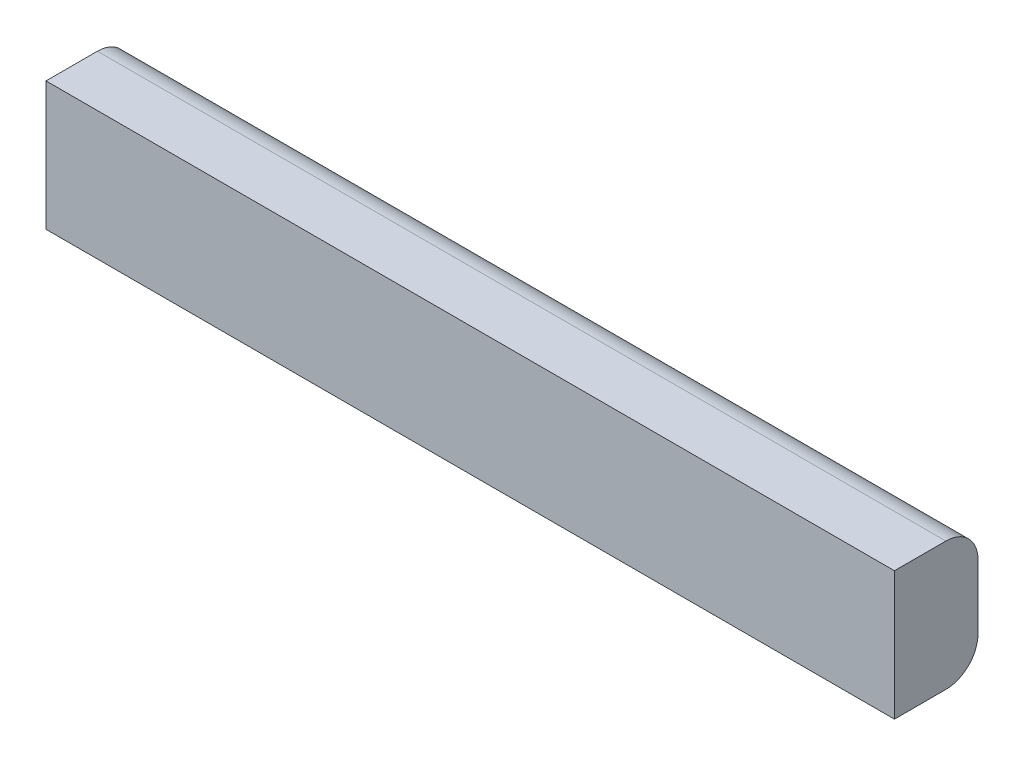
ISO-10303-21;
HEADER;
FILE_DESCRIPTION(('STEP AP214'),'2;1');
FILE_NAME('part.step','',(''),(''),'','','');
FILE_SCHEMA(('AUTOMOTIVE_DESIGN { 1 0 10303 214 1 1 1 1 }'));
ENDSEC;
DATA;
#1=APPLICATION_CONTEXT('core data for automotive mechanical design processes');
#2=APPLICATION_PROTOCOL_DEFINITION('international standard','automotive_design',2000,#1);
#3=PRODUCT_CONTEXT('',#1,'mechanical');
#4=PRODUCT('Part','Part','',(#3));
#5=PRODUCT_RELATED_PRODUCT_CATEGORY('part','',(#4));
#6=PRODUCT_DEFINITION_FORMATION('','',#4);
#7=PRODUCT_DEFINITION_CONTEXT('part definition',#1,'design');
#8=PRODUCT_DEFINITION('design','',#6,#7);
#9=PRODUCT_DEFINITION_SHAPE('','',#8);
#10=(LENGTH_UNIT() NAMED_UNIT(*) SI_UNIT(.MILLI.,.METRE.));
#11=(NAMED_UNIT(*) PLANE_ANGLE_UNIT() SI_UNIT($,.RADIAN.));
#12=(NAMED_UNIT(*) SI_UNIT($,.STERADIAN.) SOLID_ANGLE_UNIT());
#13=UNCERTAINTY_MEASURE_WITH_UNIT(LENGTH_MEASURE(1.E-05),#10,'distance_accuracy_value','');
#14=(GEOMETRIC_REPRESENTATION_CONTEXT(3) GLOBAL_UNCERTAINTY_ASSIGNED_CONTEXT((#13)) GLOBAL_UNIT_ASSIGNED_CONTEXT((#10,
#11,#12)) REPRESENTATION_CONTEXT('',''));
#15=CARTESIAN_POINT('',(0.,0.,0.));
#16=DIRECTION('',(0.,0.,1.));
#17=DIRECTION('',(1.,0.,0.));
#18=AXIS2_PLACEMENT_3D('',#15,#16,#17);
#19=CARTESIAN_POINT('',(419.1,66.0216606498195,1.42635379061369));
#20=DIRECTION('',(0.,0.,-1.));
#21=DIRECTION('',(0.,1.,0.));
#22=AXIS2_PLACEMENT_3D('',#19,#20,#21);
#23=PLANE('',#22);
#24=DIRECTION('',(0.,-1.,0.));
#25=VECTOR('',#24,1.);
#26=CARTESIAN_POINT('',(-419.1,66.0216606498195,1.42635379061369));
#27=LINE('',#26,#25);
#28=CARTESIAN_POINT('',(-419.1,66.0216606498195,1.42635379061369));
#29=VERTEX_POINT('',#28);
#30=CARTESIAN_POINT('',(-419.1,-60.9783393501805,1.42635379061368));
#31=VERTEX_POINT('',#30);
#32=EDGE_CURVE('E117',#29,#31,#27,.T.);
#33=ORIENTED_EDGE('',*,*,#32,.T.);
#34=DIRECTION('',(-1.,0.,0.));
#35=VECTOR('',#34,1.);
#36=CARTESIAN_POINT('',(419.1,-60.9783393501805,1.42635379061368));
#37=LINE('',#36,#35);
#38=CARTESIAN_POINT('',(419.1,-60.9783393501805,1.42635379061368));
#39=VERTEX_POINT('',#38);
#40=EDGE_CURVE('E11',#39,#31,#37,.T.);
#41=ORIENTED_EDGE('',*,*,#40,.F.);
#42=DIRECTION('',(0.,-1.,0.));
#43=VECTOR('',#42,1.);
#44=CARTESIAN_POINT('',(419.1,66.0216606498195,1.42635379061369));
#45=LINE('',#44,#43);
#46=CARTESIAN_POINT('',(419.1,66.0216606498195,1.42635379061369));
#47=VERTEX_POINT('',#46);
#48=EDGE_CURVE('E127',#47,#39,#45,.T.);
#49=ORIENTED_EDGE('',*,*,#48,.F.);
#50=DIRECTION('',(-1.,0.,0.));
#51=VECTOR('',#50,1.);
#52=CARTESIAN_POINT('',(419.1,66.0216606498195,1.42635379061369));
#53=LINE('',#52,#51);
#54=EDGE_CURVE('E113',#47,#29,#53,.T.);
#55=ORIENTED_EDGE('',*,*,#54,.T.);
#56=EDGE_LOOP('',(#33,#41,#49,#55));
#57=FACE_BOUND('',#56,.T.);
#58=ADVANCED_FACE('F33',(#57),#23,.F.);
#59=CARTESIAN_POINT('',(419.1,-60.9783393501805,-49.3736462093863));
#60=DIRECTION('',(0.,1.,0.));
#61=DIRECTION('',(0.,0.,1.));
#62=AXIS2_PLACEMENT_3D('',#59,#60,#61);
#63=PLANE('',#62);
#64=DIRECTION('',(0.,0.,-1.));
#65=VECTOR('',#64,1.);
#66=CARTESIAN_POINT('',(-419.1,-60.9783393501805,-49.3736462093863));
#67=LINE('',#66,#65);
#68=CARTESIAN_POINT('',(-419.1,-60.9783393501805,-49.3736462093863));
#69=VERTEX_POINT('',#68);
#70=EDGE_CURVE('E120',#31,#69,#67,.T.);
#71=ORIENTED_EDGE('',*,*,#70,.T.);
#72=DIRECTION('',(-1.,0.,0.));
#73=VECTOR('',#72,1.);
#74=CARTESIAN_POINT('',(419.1,-60.9783393501805,-49.3736462093863));
#75=LINE('',#74,#73);
#76=CARTESIAN_POINT('',(419.1,-60.9783393501805,-49.3736462093863));
#77=VERTEX_POINT('',#76);
#78=EDGE_CURVE('E41',#77,#69,#75,.T.);
#79=ORIENTED_EDGE('',*,*,#78,.F.);
#80=DIRECTION('',(0.,0.,-1.));
#81=VECTOR('',#80,1.);
#82=CARTESIAN_POINT('',(419.1,-60.9783393501805,-49.3736462093863));
#83=LINE('',#82,#81);
#84=EDGE_CURVE('E86',#39,#77,#83,.T.);
#85=ORIENTED_EDGE('',*,*,#84,.F.);
#86=ORIENTED_EDGE('',*,*,#40,.T.);
#87=EDGE_LOOP('',(#71,#79,#85,#86));
#88=FACE_BOUND('',#87,.T.);
#89=ADVANCED_FACE('F151',(#88),#63,.F.);
#90=CARTESIAN_POINT('',(419.1,-29.2283393501805,-49.3736462093863));
#91=DIRECTION('',(-1.,0.,0.));
#92=DIRECTION('',(0.,0.,1.));
#93=AXIS2_PLACEMENT_3D('',#90,#91,#92);
#94=CYLINDRICAL_SURFACE('',#93,31.75);
#95=CARTESIAN_POINT('',(-419.1,-29.2283393501805,-49.3736462093863));
#96=DIRECTION('',(1.,0.,0.));
#97=DIRECTION('',(0.,0.,1.));
#98=AXIS2_PLACEMENT_3D('',#95,#96,#97);
#99=CIRCLE('',#98,31.75);
#100=CARTESIAN_POINT('',(-419.1,-29.2283393501805,-81.1236462093863));
#101=VERTEX_POINT('',#100);
#102=EDGE_CURVE('E122',#69,#101,#99,.T.);
#103=ORIENTED_EDGE('',*,*,#102,.T.);
#104=DIRECTION('',(-1.,0.,0.));
#105=VECTOR('',#104,1.);
#106=CARTESIAN_POINT('',(419.1,-29.2283393501805,-81.1236462093863));
#107=LINE('',#106,#105);
#108=CARTESIAN_POINT('',(419.1,-29.2283393501805,-81.1236462093863));
#109=VERTEX_POINT('',#108);
#110=EDGE_CURVE('E108',#109,#101,#107,.T.);
#111=ORIENTED_EDGE('',*,*,#110,.F.);
#112=CARTESIAN_POINT('',(419.1,-29.2283393501805,-49.3736462093863));
#113=DIRECTION('',(1.,0.,0.));
#114=DIRECTION('',(0.,0.,1.));
#115=AXIS2_PLACEMENT_3D('',#112,#113,#114);
#116=CIRCLE('',#115,31.75);
#117=EDGE_CURVE('E99',#77,#109,#116,.T.);
#118=ORIENTED_EDGE('',*,*,#117,.F.);
#119=ORIENTED_EDGE('',*,*,#78,.T.);
#120=EDGE_LOOP('',(#103,#111,#118,#119));
#121=FACE_BOUND('',#120,.T.);
#122=ADVANCED_FACE('F133',(#121),#94,.T.);
#123=CARTESIAN_POINT('',(419.1,34.2716606498195,-81.1236462093863));
#124=DIRECTION('',(0.,0.,1.));
#125=DIRECTION('',(0.,-1.,0.));
#126=AXIS2_PLACEMENT_3D('',#123,#124,#125);
#127=PLANE('',#126);
#128=DIRECTION('',(0.,1.,0.));
#129=VECTOR('',#128,1.);
#130=CARTESIAN_POINT('',(-419.1,34.2716606498195,-81.1236462093863));
#131=LINE('',#130,#129);
#132=CARTESIAN_POINT('',(-419.1,34.2716606498195,-81.1236462093863));
#133=VERTEX_POINT('',#132);
#134=EDGE_CURVE('E107',#101,#133,#131,.T.);
#135=ORIENTED_EDGE('',*,*,#134,.T.);
#136=DIRECTION('',(-1.,0.,0.));
#137=VECTOR('',#136,1.);
#138=CARTESIAN_POINT('',(419.1,34.2716606498195,-81.1236462093863));
#139=LINE('',#138,#137);
#140=CARTESIAN_POINT('',(419.1,34.2716606498195,-81.1236462093863));
#141=VERTEX_POINT('',#140);
#142=EDGE_CURVE('E104',#141,#133,#139,.T.);
#143=ORIENTED_EDGE('',*,*,#142,.F.);
#144=DIRECTION('',(0.,1.,0.));
#145=VECTOR('',#144,1.);
#146=CARTESIAN_POINT('',(419.1,34.2716606498195,-81.1236462093863));
#147=LINE('',#146,#145);
#148=EDGE_CURVE('E93',#109,#141,#147,.T.);
#149=ORIENTED_EDGE('',*,*,#148,.F.);
#150=ORIENTED_EDGE('',*,*,#110,.T.);
#151=EDGE_LOOP('',(#135,#143,#149,#150));
#152=FACE_BOUND('',#151,.T.);
#153=ADVANCED_FACE('F105',(#152),#127,.F.);
#154=CARTESIAN_POINT('',(419.1,34.2716606498195,-49.3736462093863));
#155=DIRECTION('',(-1.,0.,0.));
#156=DIRECTION('',(0.,0.,1.));
#157=AXIS2_PLACEMENT_3D('',#154,#155,#156);
#158=CYLINDRICAL_SURFACE('',#157,31.75);
#159=CARTESIAN_POINT('',(-419.1,34.2716606498195,-49.3736462093863));
#160=DIRECTION('',(1.,0.,0.));
#161=DIRECTION('',(0.,0.,1.));
#162=AXIS2_PLACEMENT_3D('',#159,#160,#161);
#163=CIRCLE('',#162,31.75);
#164=CARTESIAN_POINT('',(-419.1,66.0216606498195,-49.3736462093862));
#165=VERTEX_POINT('',#164);
#166=EDGE_CURVE('E72',#133,#165,#163,.T.);
#167=ORIENTED_EDGE('',*,*,#166,.T.);
#168=DIRECTION('',(-1.,0.,0.));
#169=VECTOR('',#168,1.);
#170=CARTESIAN_POINT('',(419.1,66.0216606498195,-49.3736462093862));
#171=LINE('',#170,#169);
#172=CARTESIAN_POINT('',(419.1,66.0216606498195,-49.3736462093862));
#173=VERTEX_POINT('',#172);
#174=EDGE_CURVE('E109',#173,#165,#171,.T.);
#175=ORIENTED_EDGE('',*,*,#174,.F.);
#176=CARTESIAN_POINT('',(419.1,34.2716606498195,-49.3736462093863));
#177=DIRECTION('',(1.,0.,0.));
#178=DIRECTION('',(0.,0.,1.));
#179=AXIS2_PLACEMENT_3D('',#176,#177,#178);
#180=CIRCLE('',#179,31.75);
#181=EDGE_CURVE('E97',#141,#173,#180,.T.);
#182=ORIENTED_EDGE('',*,*,#181,.F.);
#183=ORIENTED_EDGE('',*,*,#142,.T.);
#184=EDGE_LOOP('',(#167,#175,#182,#183));
#185=FACE_BOUND('',#184,.T.);
#186=ADVANCED_FACE('F111',(#185),#158,.T.);
#187=CARTESIAN_POINT('',(419.1,66.0216606498195,-49.3736462093862));
#188=DIRECTION('',(0.,-1.,0.));
#189=DIRECTION('',(0.,0.,-1.));
#190=AXIS2_PLACEMENT_3D('',#187,#188,#189);
#191=PLANE('',#190);
#192=DIRECTION('',(0.,0.,1.));
#193=VECTOR('',#192,1.);
#194=CARTESIAN_POINT('',(-419.1,66.0216606498195,-49.3736462093862));
#195=LINE('',#194,#193);
#196=EDGE_CURVE('E78',#165,#29,#195,.T.);
#197=ORIENTED_EDGE('',*,*,#196,.T.);
#198=ORIENTED_EDGE('',*,*,#54,.F.);
#199=DIRECTION('',(0.,0.,1.));
#200=VECTOR('',#199,1.);
#201=CARTESIAN_POINT('',(419.1,66.0216606498195,-49.3736462093862));
#202=LINE('',#201,#200);
#203=EDGE_CURVE('E49',#173,#47,#202,.T.);
#204=ORIENTED_EDGE('',*,*,#203,.F.);
#205=ORIENTED_EDGE('',*,*,#174,.T.);
#206=EDGE_LOOP('',(#197,#198,#204,#205));
#207=FACE_BOUND('',#206,.T.);
#208=ADVANCED_FACE('F140',(#207),#191,.F.);
#209=CARTESIAN_POINT('',(419.1,-29.2283393501805,-49.3736462093863));
#210=DIRECTION('',(-1.,0.,0.));
#211=DIRECTION('',(0.,0.,1.));
#212=AXIS2_PLACEMENT_3D('',#209,#210,#211);
#213=PLANE('',#212);
#214=ORIENTED_EDGE('',*,*,#48,.T.);
#215=ORIENTED_EDGE('',*,*,#84,.T.);
#216=ORIENTED_EDGE('',*,*,#117,.T.);
#217=ORIENTED_EDGE('',*,*,#148,.T.);
#218=ORIENTED_EDGE('',*,*,#181,.T.);
#219=ORIENTED_EDGE('',*,*,#203,.T.);
#220=EDGE_LOOP('',(#214,#215,#216,#217,#218,#219));
#221=FACE_BOUND('',#220,.T.);
#222=ADVANCED_FACE('F95',(#221),#213,.F.);
#223=CARTESIAN_POINT('',(-419.1,-29.2283393501805,-49.3736462093863));
#224=DIRECTION('',(-1.,0.,0.));
#225=DIRECTION('',(0.,0.,1.));
#226=AXIS2_PLACEMENT_3D('',#223,#224,#225);
#227=PLANE('',#226);
#228=ORIENTED_EDGE('',*,*,#32,.F.);
#229=ORIENTED_EDGE('',*,*,#196,.F.);
#230=ORIENTED_EDGE('',*,*,#166,.F.);
#231=ORIENTED_EDGE('',*,*,#134,.F.);
#232=ORIENTED_EDGE('',*,*,#102,.F.);
#233=ORIENTED_EDGE('',*,*,#70,.F.);
#234=EDGE_LOOP('',(#228,#229,#230,#231,#232,#233));
#235=FACE_BOUND('',#234,.T.);
#236=ADVANCED_FACE('F136',(#235),#227,.T.);
#237=CLOSED_SHELL('',(#58,#89,#122,#153,#186,#208,#222,#236));
#238=MANIFOLD_SOLID_BREP('B2',#237);
#239=ADVANCED_BREP_SHAPE_REPRESENTATION('',(#18,#238),#14);
#240=SHAPE_DEFINITION_REPRESENTATION(#9,#239);
ENDSEC;
END-ISO-10303-21;
